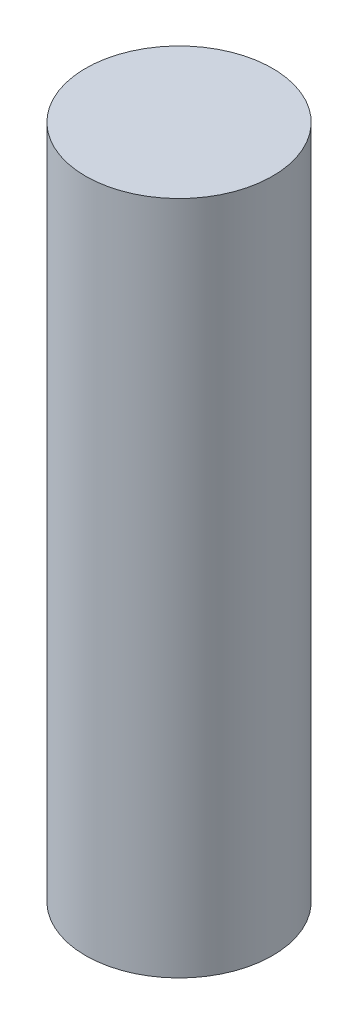
ISO-10303-21;
HEADER;
FILE_DESCRIPTION(('STEP AP214'),'2;1');
FILE_NAME('part.step','',(''),(''),'','','');
FILE_SCHEMA(('AUTOMOTIVE_DESIGN { 1 0 10303 214 1 1 1 1 }'));
ENDSEC;
DATA;
#1=APPLICATION_CONTEXT('core data for automotive mechanical design processes');
#2=APPLICATION_PROTOCOL_DEFINITION('international standard','automotive_design',2000,#1);
#3=PRODUCT_CONTEXT('',#1,'mechanical');
#4=PRODUCT('Part','Part','',(#3));
#5=PRODUCT_RELATED_PRODUCT_CATEGORY('part','',(#4));
#6=PRODUCT_DEFINITION_FORMATION('','',#4);
#7=PRODUCT_DEFINITION_CONTEXT('part definition',#1,'design');
#8=PRODUCT_DEFINITION('design','',#6,#7);
#9=PRODUCT_DEFINITION_SHAPE('','',#8);
#10=(LENGTH_UNIT() NAMED_UNIT(*) SI_UNIT(.MILLI.,.METRE.));
#11=(NAMED_UNIT(*) PLANE_ANGLE_UNIT() SI_UNIT($,.RADIAN.));
#12=(NAMED_UNIT(*) SI_UNIT($,.STERADIAN.) SOLID_ANGLE_UNIT());
#13=UNCERTAINTY_MEASURE_WITH_UNIT(LENGTH_MEASURE(1.E-05),#10,'distance_accuracy_value','');
#14=(GEOMETRIC_REPRESENTATION_CONTEXT(3) GLOBAL_UNCERTAINTY_ASSIGNED_CONTEXT((#13)) GLOBAL_UNIT_ASSIGNED_CONTEXT((#10,
#11,#12)) REPRESENTATION_CONTEXT('',''));
#15=CARTESIAN_POINT('',(0.,0.,0.));
#16=DIRECTION('',(0.,0.,1.));
#17=DIRECTION('',(1.,0.,0.));
#18=AXIS2_PLACEMENT_3D('',#15,#16,#17);
#19=CARTESIAN_POINT('',(0.,65.,0.));
#20=DIRECTION('',(0.,-1.,0.));
#21=DIRECTION('',(0.,0.,-1.));
#22=AXIS2_PLACEMENT_3D('',#19,#20,#21);
#23=CYLINDRICAL_SURFACE('',#22,9.);
#24=CARTESIAN_POINT('',(0.,65.,0.));
#25=DIRECTION('',(0.,1.,0.));
#26=DIRECTION('',(0.,0.,1.));
#27=AXIS2_PLACEMENT_3D('',#24,#25,#26);
#28=CIRCLE('',#27,9.);
#29=CARTESIAN_POINT('',(0.,65.,9.));
#30=VERTEX_POINT('',#29);
#31=EDGE_CURVE('E10',#30,#30,#28,.T.);
#32=ORIENTED_EDGE('',*,*,#31,.F.);
#33=EDGE_LOOP('',(#32));
#34=FACE_BOUND('',#33,.T.);
#35=CARTESIAN_POINT('',(0.,0.,0.));
#36=DIRECTION('',(0.,1.,0.));
#37=DIRECTION('',(0.,0.,1.));
#38=AXIS2_PLACEMENT_3D('',#35,#36,#37);
#39=CIRCLE('',#38,9.);
#40=CARTESIAN_POINT('',(0.,0.,9.));
#41=VERTEX_POINT('',#40);
#42=EDGE_CURVE('E40',#41,#41,#39,.T.);
#43=ORIENTED_EDGE('',*,*,#42,.T.);
#44=EDGE_LOOP('',(#43));
#45=FACE_BOUND('',#44,.T.);
#46=ADVANCED_FACE('F37',(#34,#45),#23,.T.);
#47=CARTESIAN_POINT('',(0.,65.,0.));
#48=DIRECTION('',(0.,1.,0.));
#49=DIRECTION('',(0.,0.,1.));
#50=AXIS2_PLACEMENT_3D('',#47,#48,#49);
#51=PLANE('',#50);
#52=ORIENTED_EDGE('',*,*,#31,.T.);
#53=EDGE_LOOP('',(#52));
#54=FACE_BOUND('',#53,.T.);
#55=ADVANCED_FACE('F52',(#54),#51,.T.);
#56=CARTESIAN_POINT('',(0.,0.,0.));
#57=DIRECTION('',(0.,1.,0.));
#58=DIRECTION('',(0.,0.,1.));
#59=AXIS2_PLACEMENT_3D('',#56,#57,#58);
#60=PLANE('',#59);
#61=ORIENTED_EDGE('',*,*,#42,.F.);
#62=EDGE_LOOP('',(#61));
#63=FACE_BOUND('',#62,.T.);
#64=ADVANCED_FACE('F50',(#63),#60,.F.);
#65=CLOSED_SHELL('',(#46,#55,#64));
#66=MANIFOLD_SOLID_BREP('B2',#65);
#67=ADVANCED_BREP_SHAPE_REPRESENTATION('',(#18,#66),#14);
#68=SHAPE_DEFINITION_REPRESENTATION(#9,#67);
ENDSEC;
END-ISO-10303-21;
